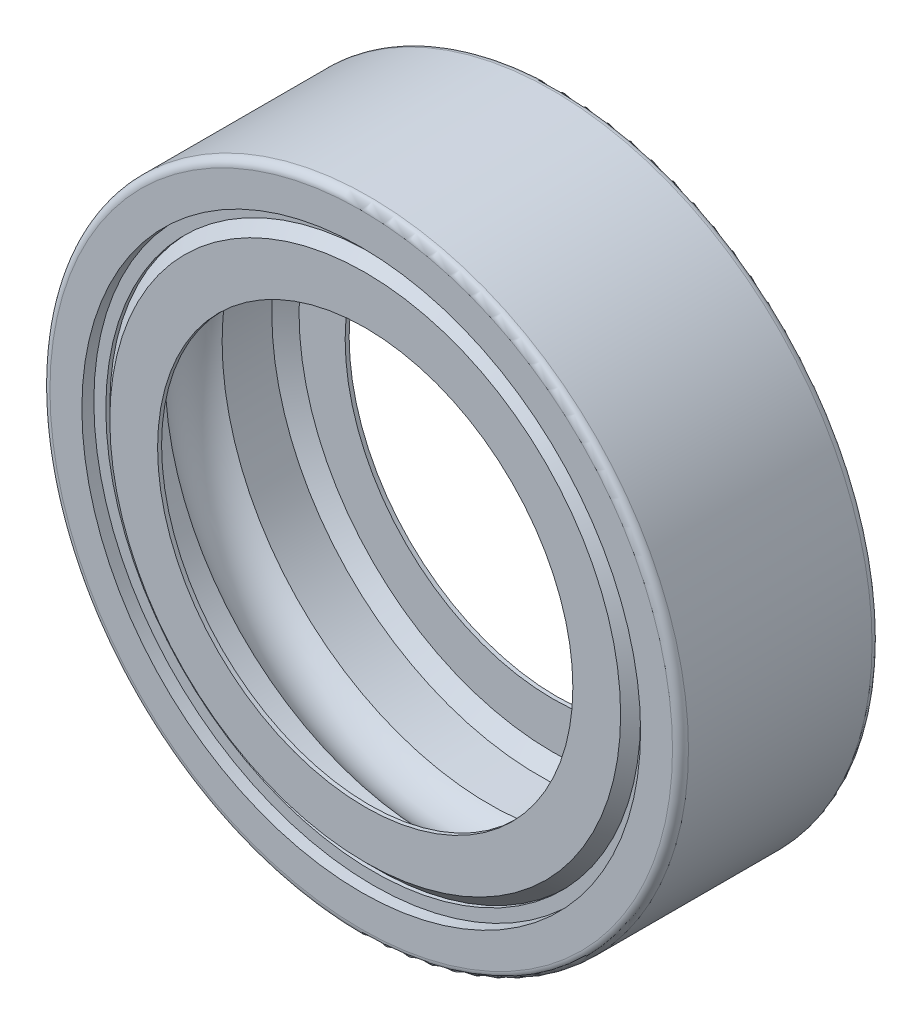
ISO-10303-21;
HEADER;
FILE_DESCRIPTION(('STEP AP214'),'2;1');
FILE_NAME('part.step','',(''),(''),'','','');
FILE_SCHEMA(('AUTOMOTIVE_DESIGN { 1 0 10303 214 1 1 1 1 }'));
ENDSEC;
DATA;
#1=APPLICATION_CONTEXT('core data for automotive mechanical design processes');
#2=APPLICATION_PROTOCOL_DEFINITION('international standard','automotive_design',2000,#1);
#3=PRODUCT_CONTEXT('',#1,'mechanical');
#4=PRODUCT('Part','Part','',(#3));
#5=PRODUCT_RELATED_PRODUCT_CATEGORY('part','',(#4));
#6=PRODUCT_DEFINITION_FORMATION('','',#4);
#7=PRODUCT_DEFINITION_CONTEXT('part definition',#1,'design');
#8=PRODUCT_DEFINITION('design','',#6,#7);
#9=PRODUCT_DEFINITION_SHAPE('','',#8);
#10=(LENGTH_UNIT() NAMED_UNIT(*) SI_UNIT(.MILLI.,.METRE.));
#11=(NAMED_UNIT(*) PLANE_ANGLE_UNIT() SI_UNIT($,.RADIAN.));
#12=(NAMED_UNIT(*) SI_UNIT($,.STERADIAN.) SOLID_ANGLE_UNIT());
#13=UNCERTAINTY_MEASURE_WITH_UNIT(LENGTH_MEASURE(1.E-05),#10,'distance_accuracy_value','');
#14=(GEOMETRIC_REPRESENTATION_CONTEXT(3) GLOBAL_UNCERTAINTY_ASSIGNED_CONTEXT((#13)) GLOBAL_UNIT_ASSIGNED_CONTEXT((#10,
#11,#12)) REPRESENTATION_CONTEXT('',''));
#15=CARTESIAN_POINT('',(0.,0.,0.));
#16=DIRECTION('',(0.,0.,1.));
#17=DIRECTION('',(1.,0.,0.));
#18=AXIS2_PLACEMENT_3D('',#15,#16,#17);
#19=CARTESIAN_POINT('',(0.,0.,2.10000000000001));
#20=DIRECTION('',(0.,0.,-1.));
#21=DIRECTION('',(-1.,0.,0.));
#22=AXIS2_PLACEMENT_3D('',#19,#20,#21);
#23=CONICAL_SURFACE('',#22,6.7,0.785398163397443);
#24=CARTESIAN_POINT('',(0.,0.,2.40000000000001));
#25=DIRECTION('',(0.,0.,1.));
#26=DIRECTION('',(1.,0.,0.));
#27=AXIS2_PLACEMENT_3D('',#24,#25,#26);
#28=CIRCLE('',#27,6.4);
#29=CARTESIAN_POINT('',(6.4,0.,2.40000000000001));
#30=VERTEX_POINT('',#29);
#31=EDGE_CURVE('E110',#30,#30,#28,.T.);
#32=ORIENTED_EDGE('',*,*,#31,.F.);
#33=EDGE_LOOP('',(#32));
#34=FACE_BOUND('',#33,.T.);
#35=CARTESIAN_POINT('',(0.,0.,2.10000000000001));
#36=DIRECTION('',(0.,0.,1.));
#37=DIRECTION('',(1.,0.,0.));
#38=AXIS2_PLACEMENT_3D('',#35,#36,#37);
#39=CIRCLE('',#38,6.7);
#40=CARTESIAN_POINT('',(6.7,0.,2.10000000000001));
#41=VERTEX_POINT('',#40);
#42=EDGE_CURVE('E10',#41,#41,#39,.T.);
#43=ORIENTED_EDGE('',*,*,#42,.T.);
#44=EDGE_LOOP('',(#43));
#45=FACE_BOUND('',#44,.T.);
#46=ADVANCED_FACE('F34',(#34,#45),#23,.T.);
#47=CARTESIAN_POINT('',(0.,0.,6.75539907110854));
#48=DIRECTION('',(0.,0.,1.));
#49=DIRECTION('',(1.,0.,0.));
#50=AXIS2_PLACEMENT_3D('',#47,#48,#49);
#51=CYLINDRICAL_SURFACE('',#50,6.7);
#52=ORIENTED_EDGE('',*,*,#42,.F.);
#53=EDGE_LOOP('',(#52));
#54=FACE_BOUND('',#53,.T.);
#55=CARTESIAN_POINT('',(0.,0.,2.20000000000001));
#56=DIRECTION('',(0.,0.,1.));
#57=DIRECTION('',(1.,0.,0.));
#58=AXIS2_PLACEMENT_3D('',#55,#56,#57);
#59=CIRCLE('',#58,6.7);
#60=CARTESIAN_POINT('',(6.7,0.,2.20000000000001));
#61=VERTEX_POINT('',#60);
#62=EDGE_CURVE('E40',#61,#61,#59,.T.);
#63=ORIENTED_EDGE('',*,*,#62,.T.);
#64=EDGE_LOOP('',(#63));
#65=FACE_BOUND('',#64,.T.);
#66=ADVANCED_FACE('F117',(#54,#65),#51,.F.);
#67=CARTESIAN_POINT('',(0.,7.,2.20000000000001));
#68=DIRECTION('',(0.,0.,-1.));
#69=DIRECTION('',(-1.,0.,0.));
#70=AXIS2_PLACEMENT_3D('',#67,#68,#69);
#71=PLANE('',#70);
#72=ORIENTED_EDGE('',*,*,#62,.F.);
#73=EDGE_LOOP('',(#72));
#74=FACE_BOUND('',#73,.T.);
#75=CARTESIAN_POINT('',(0.,0.,2.20000000000001));
#76=DIRECTION('',(0.,0.,1.));
#77=DIRECTION('',(1.,0.,0.));
#78=AXIS2_PLACEMENT_3D('',#75,#76,#77);
#79=CIRCLE('',#78,7.);
#80=CARTESIAN_POINT('',(7.,0.,2.20000000000001));
#81=VERTEX_POINT('',#80);
#82=EDGE_CURVE('E44',#81,#81,#79,.T.);
#83=ORIENTED_EDGE('',*,*,#82,.T.);
#84=EDGE_LOOP('',(#83));
#85=FACE_BOUND('',#84,.T.);
#86=ADVANCED_FACE('F121',(#74,#85),#71,.F.);
#87=CARTESIAN_POINT('',(0.,0.,6.75539907110854));
#88=DIRECTION('',(0.,0.,1.));
#89=DIRECTION('',(1.,0.,0.));
#90=AXIS2_PLACEMENT_3D('',#87,#88,#89);
#91=CYLINDRICAL_SURFACE('',#90,7.);
#92=ORIENTED_EDGE('',*,*,#82,.F.);
#93=EDGE_LOOP('',(#92));
#94=FACE_BOUND('',#93,.T.);
#95=CARTESIAN_POINT('',(0.,0.,2.50000000000001));
#96=DIRECTION('',(0.,0.,1.));
#97=DIRECTION('',(1.,0.,0.));
#98=AXIS2_PLACEMENT_3D('',#95,#96,#97);
#99=CIRCLE('',#98,7.);
#100=CARTESIAN_POINT('',(7.,0.,2.50000000000001));
#101=VERTEX_POINT('',#100);
#102=EDGE_CURVE('E48',#101,#101,#99,.T.);
#103=ORIENTED_EDGE('',*,*,#102,.T.);
#104=EDGE_LOOP('',(#103));
#105=FACE_BOUND('',#104,.T.);
#106=ADVANCED_FACE('F126',(#94,#105),#91,.F.);
#107=CARTESIAN_POINT('',(0.,7.,2.50000000000001));
#108=DIRECTION('',(0.,0.,-1.));
#109=DIRECTION('',(-1.,0.,0.));
#110=AXIS2_PLACEMENT_3D('',#107,#108,#109);
#111=PLANE('',#110);
#112=ORIENTED_EDGE('',*,*,#102,.F.);
#113=EDGE_LOOP('',(#112));
#114=FACE_BOUND('',#113,.T.);
#115=CARTESIAN_POINT('',(0.,0.,2.50000000000001));
#116=DIRECTION('',(0.,0.,1.));
#117=DIRECTION('',(1.,0.,0.));
#118=AXIS2_PLACEMENT_3D('',#115,#116,#117);
#119=CIRCLE('',#118,7.8);
#120=CARTESIAN_POINT('',(7.8,0.,2.50000000000001));
#121=VERTEX_POINT('',#120);
#122=EDGE_CURVE('E53',#121,#121,#119,.T.);
#123=ORIENTED_EDGE('',*,*,#122,.T.);
#124=EDGE_LOOP('',(#123));
#125=FACE_BOUND('',#124,.T.);
#126=ADVANCED_FACE('F132',(#114,#125),#111,.F.);
#127=CARTESIAN_POINT('',(0.,0.,2.30000000000001));
#128=DIRECTION('',(0.,0.,1.));
#129=DIRECTION('',(1.,0.,0.));
#130=AXIS2_PLACEMENT_3D('',#127,#128,#129);
#131=TOROIDAL_SURFACE('',#130,7.8,0.2);
#132=ORIENTED_EDGE('',*,*,#122,.F.);
#133=EDGE_LOOP('',(#132));
#134=FACE_BOUND('',#133,.T.);
#135=CARTESIAN_POINT('',(0.,0.,2.30000000000001));
#136=DIRECTION('',(0.,0.,1.));
#137=DIRECTION('',(1.,0.,0.));
#138=AXIS2_PLACEMENT_3D('',#135,#136,#137);
#139=CIRCLE('',#138,8.);
#140=CARTESIAN_POINT('',(8.,0.,2.30000000000001));
#141=VERTEX_POINT('',#140);
#142=EDGE_CURVE('E56',#141,#141,#139,.T.);
#143=ORIENTED_EDGE('',*,*,#142,.T.);
#144=EDGE_LOOP('',(#143));
#145=FACE_BOUND('',#144,.T.);
#146=ADVANCED_FACE('F136',(#134,#145),#131,.T.);
#147=CARTESIAN_POINT('',(0.,0.,6.75539907110854));
#148=DIRECTION('',(0.,0.,1.));
#149=DIRECTION('',(1.,0.,0.));
#150=AXIS2_PLACEMENT_3D('',#147,#148,#149);
#151=CYLINDRICAL_SURFACE('',#150,8.);
#152=ORIENTED_EDGE('',*,*,#142,.F.);
#153=EDGE_LOOP('',(#152));
#154=FACE_BOUND('',#153,.T.);
#155=CARTESIAN_POINT('',(0.,0.,-2.30000000000001));
#156=DIRECTION('',(0.,0.,1.));
#157=DIRECTION('',(1.,0.,0.));
#158=AXIS2_PLACEMENT_3D('',#155,#156,#157);
#159=CIRCLE('',#158,8.);
#160=CARTESIAN_POINT('',(8.,0.,-2.30000000000001));
#161=VERTEX_POINT('',#160);
#162=EDGE_CURVE('E59',#161,#161,#159,.T.);
#163=ORIENTED_EDGE('',*,*,#162,.T.);
#164=EDGE_LOOP('',(#163));
#165=FACE_BOUND('',#164,.T.);
#166=ADVANCED_FACE('F140',(#154,#165),#151,.T.);
#167=CARTESIAN_POINT('',(0.,0.,-2.30000000000001));
#168=DIRECTION('',(0.,0.,1.));
#169=DIRECTION('',(1.,0.,0.));
#170=AXIS2_PLACEMENT_3D('',#167,#168,#169);
#171=TOROIDAL_SURFACE('',#170,7.8,0.2);
#172=ORIENTED_EDGE('',*,*,#162,.F.);
#173=EDGE_LOOP('',(#172));
#174=FACE_BOUND('',#173,.T.);
#175=CARTESIAN_POINT('',(0.,0.,-2.50000000000001));
#176=DIRECTION('',(0.,0.,1.));
#177=DIRECTION('',(1.,0.,0.));
#178=AXIS2_PLACEMENT_3D('',#175,#176,#177);
#179=CIRCLE('',#178,7.8);
#180=CARTESIAN_POINT('',(7.8,0.,-2.50000000000001));
#181=VERTEX_POINT('',#180);
#182=EDGE_CURVE('E62',#181,#181,#179,.T.);
#183=ORIENTED_EDGE('',*,*,#182,.T.);
#184=EDGE_LOOP('',(#183));
#185=FACE_BOUND('',#184,.T.);
#186=ADVANCED_FACE('F144',(#174,#185),#171,.T.);
#187=CARTESIAN_POINT('',(0.,7.,-2.50000000000001));
#188=DIRECTION('',(0.,0.,1.));
#189=DIRECTION('',(1.,0.,0.));
#190=AXIS2_PLACEMENT_3D('',#187,#188,#189);
#191=PLANE('',#190);
#192=ORIENTED_EDGE('',*,*,#182,.F.);
#193=EDGE_LOOP('',(#192));
#194=FACE_BOUND('',#193,.T.);
#195=CARTESIAN_POINT('',(0.,0.,-2.50000000000001));
#196=DIRECTION('',(0.,0.,1.));
#197=DIRECTION('',(1.,0.,0.));
#198=AXIS2_PLACEMENT_3D('',#195,#196,#197);
#199=CIRCLE('',#198,7.);
#200=CARTESIAN_POINT('',(7.,0.,-2.50000000000001));
#201=VERTEX_POINT('',#200);
#202=EDGE_CURVE('E65',#201,#201,#199,.T.);
#203=ORIENTED_EDGE('',*,*,#202,.T.);
#204=EDGE_LOOP('',(#203));
#205=FACE_BOUND('',#204,.T.);
#206=ADVANCED_FACE('F148',(#194,#205),#191,.F.);
#207=CARTESIAN_POINT('',(0.,0.,6.75539907110854));
#208=DIRECTION('',(0.,0.,1.));
#209=DIRECTION('',(1.,0.,0.));
#210=AXIS2_PLACEMENT_3D('',#207,#208,#209);
#211=CYLINDRICAL_SURFACE('',#210,7.);
#212=ORIENTED_EDGE('',*,*,#202,.F.);
#213=EDGE_LOOP('',(#212));
#214=FACE_BOUND('',#213,.T.);
#215=CARTESIAN_POINT('',(0.,0.,-2.20000000000001));
#216=DIRECTION('',(0.,0.,1.));
#217=DIRECTION('',(1.,0.,0.));
#218=AXIS2_PLACEMENT_3D('',#215,#216,#217);
#219=CIRCLE('',#218,7.);
#220=CARTESIAN_POINT('',(7.,0.,-2.20000000000001));
#221=VERTEX_POINT('',#220);
#222=EDGE_CURVE('E68',#221,#221,#219,.T.);
#223=ORIENTED_EDGE('',*,*,#222,.T.);
#224=EDGE_LOOP('',(#223));
#225=FACE_BOUND('',#224,.T.);
#226=ADVANCED_FACE('F152',(#214,#225),#211,.F.);
#227=CARTESIAN_POINT('',(0.,7.,-2.20000000000001));
#228=DIRECTION('',(0.,0.,1.));
#229=DIRECTION('',(1.,0.,0.));
#230=AXIS2_PLACEMENT_3D('',#227,#228,#229);
#231=PLANE('',#230);
#232=ORIENTED_EDGE('',*,*,#222,.F.);
#233=EDGE_LOOP('',(#232));
#234=FACE_BOUND('',#233,.T.);
#235=CARTESIAN_POINT('',(0.,0.,-2.20000000000001));
#236=DIRECTION('',(0.,0.,1.));
#237=DIRECTION('',(1.,0.,0.));
#238=AXIS2_PLACEMENT_3D('',#235,#236,#237);
#239=CIRCLE('',#238,6.7);
#240=CARTESIAN_POINT('',(6.7,0.,-2.20000000000001));
#241=VERTEX_POINT('',#240);
#242=EDGE_CURVE('E71',#241,#241,#239,.T.);
#243=ORIENTED_EDGE('',*,*,#242,.T.);
#244=EDGE_LOOP('',(#243));
#245=FACE_BOUND('',#244,.T.);
#246=ADVANCED_FACE('F156',(#234,#245),#231,.F.);
#247=CARTESIAN_POINT('',(0.,0.,6.75539907110854));
#248=DIRECTION('',(0.,0.,1.));
#249=DIRECTION('',(1.,0.,0.));
#250=AXIS2_PLACEMENT_3D('',#247,#248,#249);
#251=CYLINDRICAL_SURFACE('',#250,6.7);
#252=ORIENTED_EDGE('',*,*,#242,.F.);
#253=EDGE_LOOP('',(#252));
#254=FACE_BOUND('',#253,.T.);
#255=CARTESIAN_POINT('',(0.,0.,-2.10000000000001));
#256=DIRECTION('',(0.,0.,1.));
#257=DIRECTION('',(1.,0.,0.));
#258=AXIS2_PLACEMENT_3D('',#255,#256,#257);
#259=CIRCLE('',#258,6.7);
#260=CARTESIAN_POINT('',(6.7,0.,-2.10000000000001));
#261=VERTEX_POINT('',#260);
#262=EDGE_CURVE('E74',#261,#261,#259,.T.);
#263=ORIENTED_EDGE('',*,*,#262,.T.);
#264=EDGE_LOOP('',(#263));
#265=FACE_BOUND('',#264,.T.);
#266=ADVANCED_FACE('F160',(#254,#265),#251,.F.);
#267=CARTESIAN_POINT('',(0.,0.,-2.40000000000001));
#268=DIRECTION('',(0.,0.,1.));
#269=DIRECTION('',(1.,0.,0.));
#270=AXIS2_PLACEMENT_3D('',#267,#268,#269);
#271=CONICAL_SURFACE('',#270,6.4,0.785398163397443);
#272=ORIENTED_EDGE('',*,*,#262,.F.);
#273=EDGE_LOOP('',(#272));
#274=FACE_BOUND('',#273,.T.);
#275=CARTESIAN_POINT('',(0.,0.,-2.40000000000001));
#276=DIRECTION('',(0.,0.,1.));
#277=DIRECTION('',(1.,0.,0.));
#278=AXIS2_PLACEMENT_3D('',#275,#276,#277);
#279=CIRCLE('',#278,6.4);
#280=CARTESIAN_POINT('',(6.4,0.,-2.40000000000001));
#281=VERTEX_POINT('',#280);
#282=EDGE_CURVE('E77',#281,#281,#279,.T.);
#283=ORIENTED_EDGE('',*,*,#282,.T.);
#284=EDGE_LOOP('',(#283));
#285=FACE_BOUND('',#284,.T.);
#286=ADVANCED_FACE('F164',(#274,#285),#271,.T.);
#287=CARTESIAN_POINT('',(0.,6.4,-2.40000000000001));
#288=DIRECTION('',(0.,0.,1.));
#289=DIRECTION('',(1.,0.,0.));
#290=AXIS2_PLACEMENT_3D('',#287,#288,#289);
#291=PLANE('',#290);
#292=ORIENTED_EDGE('',*,*,#282,.F.);
#293=EDGE_LOOP('',(#292));
#294=FACE_BOUND('',#293,.T.);
#295=CARTESIAN_POINT('',(0.,0.,-2.40000000000001));
#296=DIRECTION('',(0.,0.,1.));
#297=DIRECTION('',(1.,0.,0.));
#298=AXIS2_PLACEMENT_3D('',#295,#296,#297);
#299=CIRCLE('',#298,5.20290790050683);
#300=CARTESIAN_POINT('',(5.20290790050683,0.,-2.40000000000001));
#301=VERTEX_POINT('',#300);
#302=EDGE_CURVE('E80',#301,#301,#299,.T.);
#303=ORIENTED_EDGE('',*,*,#302,.T.);
#304=EDGE_LOOP('',(#303));
#305=FACE_BOUND('',#304,.T.);
#306=ADVANCED_FACE('F168',(#294,#305),#291,.F.);
#307=CARTESIAN_POINT('',(0.,0.,6.75539907110854));
#308=DIRECTION('',(0.,0.,1.));
#309=DIRECTION('',(1.,0.,0.));
#310=AXIS2_PLACEMENT_3D('',#307,#308,#309);
#311=CYLINDRICAL_SURFACE('',#310,5.20290790050683);
#312=ORIENTED_EDGE('',*,*,#302,.F.);
#313=EDGE_LOOP('',(#312));
#314=FACE_BOUND('',#313,.T.);
#315=CARTESIAN_POINT('',(0.,0.,-2.30000000000001));
#316=DIRECTION('',(0.,0.,1.));
#317=DIRECTION('',(1.,0.,0.));
#318=AXIS2_PLACEMENT_3D('',#315,#316,#317);
#319=CIRCLE('',#318,5.20290790050683);
#320=CARTESIAN_POINT('',(5.20290790050683,0.,-2.30000000000001));
#321=VERTEX_POINT('',#320);
#322=EDGE_CURVE('E83',#321,#321,#319,.T.);
#323=ORIENTED_EDGE('',*,*,#322,.T.);
#324=EDGE_LOOP('',(#323));
#325=FACE_BOUND('',#324,.T.);
#326=ADVANCED_FACE('F172',(#314,#325),#311,.F.);
#327=CARTESIAN_POINT('',(0.,5.20290790050683,-2.30000000000001));
#328=DIRECTION('',(0.,0.,-1.));
#329=DIRECTION('',(-1.,0.,0.));
#330=AXIS2_PLACEMENT_3D('',#327,#328,#329);
#331=PLANE('',#330);
#332=ORIENTED_EDGE('',*,*,#322,.F.);
#333=EDGE_LOOP('',(#332));
#334=FACE_BOUND('',#333,.T.);
#335=CARTESIAN_POINT('',(0.,0.,-2.30000000000001));
#336=DIRECTION('',(0.,0.,1.));
#337=DIRECTION('',(1.,0.,0.));
#338=AXIS2_PLACEMENT_3D('',#335,#336,#337);
#339=CIRCLE('',#338,6.35857864376269);
#340=CARTESIAN_POINT('',(6.35857864376269,0.,-2.30000000000001));
#341=VERTEX_POINT('',#340);
#342=EDGE_CURVE('E86',#341,#341,#339,.T.);
#343=ORIENTED_EDGE('',*,*,#342,.T.);
#344=EDGE_LOOP('',(#343));
#345=FACE_BOUND('',#344,.T.);
#346=ADVANCED_FACE('F176',(#334,#345),#331,.F.);
#347=CARTESIAN_POINT('',(0.,0.,-1.9585786437627));
#348=DIRECTION('',(0.,0.,1.));
#349=DIRECTION('',(1.,0.,0.));
#350=AXIS2_PLACEMENT_3D('',#347,#348,#349);
#351=CONICAL_SURFACE('',#350,6.7,0.785398163397443);
#352=ORIENTED_EDGE('',*,*,#342,.F.);
#353=EDGE_LOOP('',(#352));
#354=FACE_BOUND('',#353,.T.);
#355=CARTESIAN_POINT('',(0.,0.,-1.9585786437627));
#356=DIRECTION('',(0.,0.,1.));
#357=DIRECTION('',(1.,0.,0.));
#358=AXIS2_PLACEMENT_3D('',#355,#356,#357);
#359=CIRCLE('',#358,6.7);
#360=CARTESIAN_POINT('',(6.7,0.,-1.9585786437627));
#361=VERTEX_POINT('',#360);
#362=EDGE_CURVE('E89',#361,#361,#359,.T.);
#363=ORIENTED_EDGE('',*,*,#362,.T.);
#364=EDGE_LOOP('',(#363));
#365=FACE_BOUND('',#364,.T.);
#366=ADVANCED_FACE('F180',(#354,#365),#351,.F.);
#367=CARTESIAN_POINT('',(0.,0.,6.75539907110854));
#368=DIRECTION('',(0.,0.,1.));
#369=DIRECTION('',(1.,0.,0.));
#370=AXIS2_PLACEMENT_3D('',#367,#368,#369);
#371=CYLINDRICAL_SURFACE('',#370,6.7);
#372=ORIENTED_EDGE('',*,*,#362,.F.);
#373=EDGE_LOOP('',(#372));
#374=FACE_BOUND('',#373,.T.);
#375=CARTESIAN_POINT('',(0.,0.,-0.714142842854286));
#376=DIRECTION('',(0.,0.,1.));
#377=DIRECTION('',(1.,0.,0.));
#378=AXIS2_PLACEMENT_3D('',#375,#376,#377);
#379=CIRCLE('',#378,6.7);
#380=CARTESIAN_POINT('',(6.7,0.,-0.714142842854286));
#381=VERTEX_POINT('',#380);
#382=EDGE_CURVE('E92',#381,#381,#379,.T.);
#383=ORIENTED_EDGE('',*,*,#382,.T.);
#384=EDGE_LOOP('',(#383));
#385=FACE_BOUND('',#384,.T.);
#386=ADVANCED_FACE('F184',(#374,#385),#371,.F.);
#387=CARTESIAN_POINT('',(0.,0.,0.));
#388=DIRECTION('',(0.,0.,1.));
#389=DIRECTION('',(1.,0.,0.));
#390=AXIS2_PLACEMENT_3D('',#387,#388,#389);
#391=TOROIDAL_SURFACE('',#390,6.,1.);
#392=ORIENTED_EDGE('',*,*,#382,.F.);
#393=EDGE_LOOP('',(#392));
#394=FACE_BOUND('',#393,.T.);
#395=CARTESIAN_POINT('',(0.,0.,0.714142842854286));
#396=DIRECTION('',(0.,0.,1.));
#397=DIRECTION('',(1.,0.,0.));
#398=AXIS2_PLACEMENT_3D('',#395,#396,#397);
#399=CIRCLE('',#398,6.7);
#400=CARTESIAN_POINT('',(6.7,0.,0.714142842854286));
#401=VERTEX_POINT('',#400);
#402=EDGE_CURVE('E95',#401,#401,#399,.T.);
#403=ORIENTED_EDGE('',*,*,#402,.T.);
#404=EDGE_LOOP('',(#403));
#405=FACE_BOUND('',#404,.T.);
#406=ADVANCED_FACE('F188',(#394,#405),#391,.F.);
#407=CARTESIAN_POINT('',(0.,0.,6.75539907110854));
#408=DIRECTION('',(0.,0.,1.));
#409=DIRECTION('',(1.,0.,0.));
#410=AXIS2_PLACEMENT_3D('',#407,#408,#409);
#411=CYLINDRICAL_SURFACE('',#410,6.7);
#412=ORIENTED_EDGE('',*,*,#402,.F.);
#413=EDGE_LOOP('',(#412));
#414=FACE_BOUND('',#413,.T.);
#415=CARTESIAN_POINT('',(0.,0.,1.9585786437627));
#416=DIRECTION('',(0.,0.,1.));
#417=DIRECTION('',(1.,0.,0.));
#418=AXIS2_PLACEMENT_3D('',#415,#416,#417);
#419=CIRCLE('',#418,6.7);
#420=CARTESIAN_POINT('',(6.7,0.,1.9585786437627));
#421=VERTEX_POINT('',#420);
#422=EDGE_CURVE('E98',#421,#421,#419,.T.);
#423=ORIENTED_EDGE('',*,*,#422,.T.);
#424=EDGE_LOOP('',(#423));
#425=FACE_BOUND('',#424,.T.);
#426=ADVANCED_FACE('F192',(#414,#425),#411,.F.);
#427=CARTESIAN_POINT('',(0.,0.,2.30000000000001));
#428=DIRECTION('',(0.,0.,-1.));
#429=DIRECTION('',(-1.,0.,0.));
#430=AXIS2_PLACEMENT_3D('',#427,#428,#429);
#431=CONICAL_SURFACE('',#430,6.35857864376269,0.785398163397443);
#432=ORIENTED_EDGE('',*,*,#422,.F.);
#433=EDGE_LOOP('',(#432));
#434=FACE_BOUND('',#433,.T.);
#435=CARTESIAN_POINT('',(0.,0.,2.30000000000001));
#436=DIRECTION('',(0.,0.,1.));
#437=DIRECTION('',(1.,0.,0.));
#438=AXIS2_PLACEMENT_3D('',#435,#436,#437);
#439=CIRCLE('',#438,6.35857864376269);
#440=CARTESIAN_POINT('',(6.35857864376269,0.,2.30000000000001));
#441=VERTEX_POINT('',#440);
#442=EDGE_CURVE('E101',#441,#441,#439,.T.);
#443=ORIENTED_EDGE('',*,*,#442,.T.);
#444=EDGE_LOOP('',(#443));
#445=FACE_BOUND('',#444,.T.);
#446=ADVANCED_FACE('F196',(#434,#445),#431,.F.);
#447=CARTESIAN_POINT('',(0.,5.20290790050683,2.30000000000001));
#448=DIRECTION('',(0.,0.,1.));
#449=DIRECTION('',(1.,0.,0.));
#450=AXIS2_PLACEMENT_3D('',#447,#448,#449);
#451=PLANE('',#450);
#452=ORIENTED_EDGE('',*,*,#442,.F.);
#453=EDGE_LOOP('',(#452));
#454=FACE_BOUND('',#453,.T.);
#455=CARTESIAN_POINT('',(0.,0.,2.30000000000001));
#456=DIRECTION('',(0.,0.,1.));
#457=DIRECTION('',(1.,0.,0.));
#458=AXIS2_PLACEMENT_3D('',#455,#456,#457);
#459=CIRCLE('',#458,5.20290790050683);
#460=CARTESIAN_POINT('',(5.20290790050683,0.,2.30000000000001));
#461=VERTEX_POINT('',#460);
#462=EDGE_CURVE('E104',#461,#461,#459,.T.);
#463=ORIENTED_EDGE('',*,*,#462,.T.);
#464=EDGE_LOOP('',(#463));
#465=FACE_BOUND('',#464,.T.);
#466=ADVANCED_FACE('F200',(#454,#465),#451,.F.);
#467=CARTESIAN_POINT('',(0.,0.,6.75539907110854));
#468=DIRECTION('',(0.,0.,1.));
#469=DIRECTION('',(1.,0.,0.));
#470=AXIS2_PLACEMENT_3D('',#467,#468,#469);
#471=CYLINDRICAL_SURFACE('',#470,5.20290790050684);
#472=ORIENTED_EDGE('',*,*,#462,.F.);
#473=EDGE_LOOP('',(#472));
#474=FACE_BOUND('',#473,.T.);
#475=CARTESIAN_POINT('',(0.,0.,2.40000000000001));
#476=DIRECTION('',(0.,0.,1.));
#477=DIRECTION('',(1.,0.,0.));
#478=AXIS2_PLACEMENT_3D('',#475,#476,#477);
#479=CIRCLE('',#478,5.20290790050684);
#480=CARTESIAN_POINT('',(5.20290790050684,0.,2.40000000000001));
#481=VERTEX_POINT('',#480);
#482=EDGE_CURVE('E107',#481,#481,#479,.T.);
#483=ORIENTED_EDGE('',*,*,#482,.T.);
#484=EDGE_LOOP('',(#483));
#485=FACE_BOUND('',#484,.T.);
#486=ADVANCED_FACE('F204',(#474,#485),#471,.F.);
#487=CARTESIAN_POINT('',(0.,6.4,2.40000000000001));
#488=DIRECTION('',(0.,0.,-1.));
#489=DIRECTION('',(-1.,0.,0.));
#490=AXIS2_PLACEMENT_3D('',#487,#488,#489);
#491=PLANE('',#490);
#492=ORIENTED_EDGE('',*,*,#482,.F.);
#493=EDGE_LOOP('',(#492));
#494=FACE_BOUND('',#493,.T.);
#495=ORIENTED_EDGE('',*,*,#31,.T.);
#496=EDGE_LOOP('',(#495));
#497=FACE_BOUND('',#496,.T.);
#498=ADVANCED_FACE('F114',(#494,#497),#491,.F.);
#499=CLOSED_SHELL('',(#46,#66,#86,#106,#126,#146,#166,#186,#206,#226,#246,#266,#286,#306,#326,
#346,#366,#386,#406,#426,#446,#466,#486,#498));
#500=MANIFOLD_SOLID_BREP('B2',#499);
#501=ADVANCED_BREP_SHAPE_REPRESENTATION('',(#18,#500),#14);
#502=SHAPE_DEFINITION_REPRESENTATION(#9,#501);
ENDSEC;
END-ISO-10303-21;
